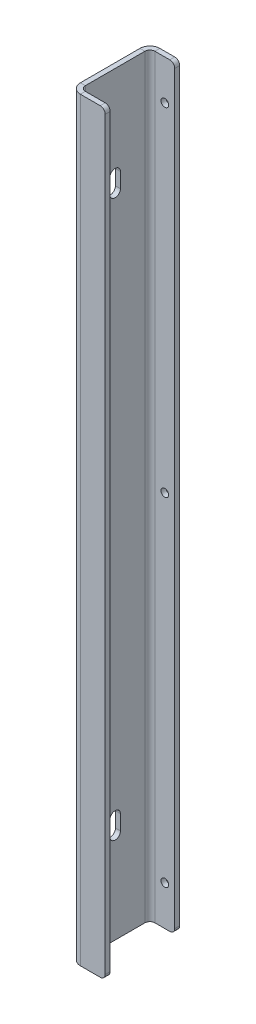
ISO-10303-21;
HEADER;
FILE_DESCRIPTION(('STEP AP214'),'2;1');
FILE_NAME('part.step','',(''),(''),'','','');
FILE_SCHEMA(('AUTOMOTIVE_DESIGN { 1 0 10303 214 1 1 1 1 }'));
ENDSEC;
DATA;
#1=APPLICATION_CONTEXT('core data for automotive mechanical design processes');
#2=APPLICATION_PROTOCOL_DEFINITION('international standard','automotive_design',2000,#1);
#3=PRODUCT_CONTEXT('',#1,'mechanical');
#4=PRODUCT('Part','Part','',(#3));
#5=PRODUCT_RELATED_PRODUCT_CATEGORY('part','',(#4));
#6=PRODUCT_DEFINITION_FORMATION('','',#4);
#7=PRODUCT_DEFINITION_CONTEXT('part definition',#1,'design');
#8=PRODUCT_DEFINITION('design','',#6,#7);
#9=PRODUCT_DEFINITION_SHAPE('','',#8);
#10=(LENGTH_UNIT() NAMED_UNIT(*) SI_UNIT(.MILLI.,.METRE.));
#11=(NAMED_UNIT(*) PLANE_ANGLE_UNIT() SI_UNIT($,.RADIAN.));
#12=(NAMED_UNIT(*) SI_UNIT($,.STERADIAN.) SOLID_ANGLE_UNIT());
#13=UNCERTAINTY_MEASURE_WITH_UNIT(LENGTH_MEASURE(1.E-05),#10,'distance_accuracy_value','');
#14=(GEOMETRIC_REPRESENTATION_CONTEXT(3) GLOBAL_UNCERTAINTY_ASSIGNED_CONTEXT((#13)) GLOBAL_UNIT_ASSIGNED_CONTEXT((#10,
#11,#12)) REPRESENTATION_CONTEXT('',''));
#15=CARTESIAN_POINT('',(0.,0.,0.));
#16=DIRECTION('',(0.,0.,1.));
#17=DIRECTION('',(1.,0.,0.));
#18=AXIS2_PLACEMENT_3D('',#15,#16,#17);
#19=CARTESIAN_POINT('',(-22.225,482.6,-6.35));
#20=DIRECTION('',(0.,1.,0.));
#21=DIRECTION('',(0.,0.,1.));
#22=AXIS2_PLACEMENT_3D('',#19,#20,#21);
#23=PLANE('',#22);
#24=DIRECTION('',(1.,0.,0.));
#25=VECTOR('',#24,1.);
#26=CARTESIAN_POINT('',(-22.225,482.6,-6.35));
#27=LINE('',#26,#25);
#28=CARTESIAN_POINT('',(-22.225,482.6,-6.35));
#29=VERTEX_POINT('',#28);
#30=CARTESIAN_POINT('',(-19.05,482.6,-6.35));
#31=VERTEX_POINT('',#30);
#32=EDGE_CURVE('E396',#29,#31,#27,.T.);
#33=ORIENTED_EDGE('',*,*,#32,.F.);
#34=CARTESIAN_POINT('',(-15.875,482.6,-6.35));
#35=DIRECTION('',(0.,1.,0.));
#36=DIRECTION('',(0.,0.,1.));
#37=AXIS2_PLACEMENT_3D('',#34,#35,#36);
#38=CIRCLE('',#37,6.35);
#39=CARTESIAN_POINT('',(-15.875,482.6,0.));
#40=VERTEX_POINT('',#39);
#41=EDGE_CURVE('E302',#40,#29,#38,.F.);
#42=ORIENTED_EDGE('',*,*,#41,.F.);
#43=DIRECTION('',(0.,0.,1.));
#44=VECTOR('',#43,1.);
#45=CARTESIAN_POINT('',(-15.875,482.6,-3.175));
#46=LINE('',#45,#44);
#47=CARTESIAN_POINT('',(-15.875,482.6,-3.175));
#48=VERTEX_POINT('',#47);
#49=EDGE_CURVE('E393',#48,#40,#46,.T.);
#50=ORIENTED_EDGE('',*,*,#49,.F.);
#51=CARTESIAN_POINT('',(-15.875,482.6,-6.35));
#52=DIRECTION('',(0.,1.,0.));
#53=DIRECTION('',(1.,0.,0.));
#54=AXIS2_PLACEMENT_3D('',#51,#52,#53);
#55=CIRCLE('',#54,3.175);
#56=EDGE_CURVE('E309',#48,#31,#55,.F.);
#57=ORIENTED_EDGE('',*,*,#56,.T.);
#58=EDGE_LOOP('',(#33,#42,#50,#57));
#59=FACE_BOUND('',#58,.T.);
#60=ADVANCED_FACE('F41',(#59),#23,.T.);
#61=CARTESIAN_POINT('',(-15.875,482.6,-3.175));
#62=DIRECTION('',(0.,1.,0.));
#63=DIRECTION('',(0.,0.,1.));
#64=AXIS2_PLACEMENT_3D('',#61,#62,#63);
#65=PLANE('',#64);
#66=DIRECTION('',(0.,0.,-1.));
#67=VECTOR('',#66,1.);
#68=CARTESIAN_POINT('',(-22.225,482.6,0.));
#69=LINE('',#68,#67);
#70=CARTESIAN_POINT('',(-22.225,482.6,-44.45));
#71=VERTEX_POINT('',#70);
#72=EDGE_CURVE('E299',#29,#71,#69,.T.);
#73=ORIENTED_EDGE('',*,*,#72,.F.);
#74=ORIENTED_EDGE('',*,*,#32,.T.);
#75=DIRECTION('',(0.,0.,-1.));
#76=VECTOR('',#75,1.);
#77=CARTESIAN_POINT('',(-19.05,482.6,0.));
#78=LINE('',#77,#76);
#79=CARTESIAN_POINT('',(-19.05,482.6,-44.45));
#80=VERTEX_POINT('',#79);
#81=EDGE_CURVE('E312',#31,#80,#78,.T.);
#82=ORIENTED_EDGE('',*,*,#81,.T.);
#83=DIRECTION('',(-1.,0.,0.));
#84=VECTOR('',#83,1.);
#85=CARTESIAN_POINT('',(-19.05,482.6,-44.45));
#86=LINE('',#85,#84);
#87=EDGE_CURVE('E384',#80,#71,#86,.T.);
#88=ORIENTED_EDGE('',*,*,#87,.T.);
#89=EDGE_LOOP('',(#73,#74,#82,#88));
#90=FACE_BOUND('',#89,.T.);
#91=ADVANCED_FACE('F487',(#90),#65,.T.);
#92=CARTESIAN_POINT('',(-15.875,0.,0.));
#93=DIRECTION('',(0.,-1.,0.));
#94=DIRECTION('',(0.,0.,-1.));
#95=AXIS2_PLACEMENT_3D('',#92,#93,#94);
#96=PLANE('',#95);
#97=DIRECTION('',(0.,0.,-1.));
#98=VECTOR('',#97,1.);
#99=CARTESIAN_POINT('',(-15.875,0.,0.));
#100=LINE('',#99,#98);
#101=CARTESIAN_POINT('',(-15.875,0.,0.));
#102=VERTEX_POINT('',#101);
#103=CARTESIAN_POINT('',(-15.875,0.,-3.175));
#104=VERTEX_POINT('',#103);
#105=EDGE_CURVE('E390',#102,#104,#100,.T.);
#106=ORIENTED_EDGE('',*,*,#105,.F.);
#107=CARTESIAN_POINT('',(-15.875,0.,-6.35));
#108=DIRECTION('',(0.,1.,0.));
#109=DIRECTION('',(0.,0.,1.));
#110=AXIS2_PLACEMENT_3D('',#107,#108,#109);
#111=CIRCLE('',#110,6.35);
#112=CARTESIAN_POINT('',(-22.225,0.,-6.35));
#113=VERTEX_POINT('',#112);
#114=EDGE_CURVE('E330',#102,#113,#111,.F.);
#115=ORIENTED_EDGE('',*,*,#114,.T.);
#116=DIRECTION('',(-1.,0.,0.));
#117=VECTOR('',#116,1.);
#118=CARTESIAN_POINT('',(-19.05,0.,-6.35));
#119=LINE('',#118,#117);
#120=CARTESIAN_POINT('',(-19.05,0.,-6.35));
#121=VERTEX_POINT('',#120);
#122=EDGE_CURVE('E388',#121,#113,#119,.T.);
#123=ORIENTED_EDGE('',*,*,#122,.F.);
#124=CARTESIAN_POINT('',(-15.875,0.,-6.35));
#125=DIRECTION('',(0.,1.,0.));
#126=DIRECTION('',(1.,0.,0.));
#127=AXIS2_PLACEMENT_3D('',#124,#125,#126);
#128=CIRCLE('',#127,3.175);
#129=EDGE_CURVE('E337',#104,#121,#128,.F.);
#130=ORIENTED_EDGE('',*,*,#129,.F.);
#131=EDGE_LOOP('',(#106,#115,#123,#130));
#132=FACE_BOUND('',#131,.T.);
#133=ADVANCED_FACE('F475',(#132),#96,.T.);
#134=CARTESIAN_POINT('',(-19.05,0.,-6.35));
#135=DIRECTION('',(0.,-1.,0.));
#136=DIRECTION('',(0.,0.,-1.));
#137=AXIS2_PLACEMENT_3D('',#134,#135,#136);
#138=PLANE('',#137);
#139=DIRECTION('',(-1.,0.,0.));
#140=VECTOR('',#139,1.);
#141=CARTESIAN_POINT('',(0.,0.,-3.175));
#142=LINE('',#141,#140);
#143=CARTESIAN_POINT('',(-3.175,0.,-3.175));
#144=VERTEX_POINT('',#143);
#145=EDGE_CURVE('E335',#144,#104,#142,.T.);
#146=ORIENTED_EDGE('',*,*,#145,.F.);
#147=DIRECTION('',(0.,0.,1.));
#148=VECTOR('',#147,1.);
#149=CARTESIAN_POINT('',(-3.175,0.,-6.35));
#150=LINE('',#149,#148);
#151=CARTESIAN_POINT('',(-3.175,0.,0.));
#152=VERTEX_POINT('',#151);
#153=EDGE_CURVE('E414',#144,#152,#150,.T.);
#154=ORIENTED_EDGE('',*,*,#153,.T.);
#155=DIRECTION('',(-1.,0.,0.));
#156=VECTOR('',#155,1.);
#157=CARTESIAN_POINT('',(0.,0.,0.));
#158=LINE('',#157,#156);
#159=EDGE_CURVE('E333',#152,#102,#158,.T.);
#160=ORIENTED_EDGE('',*,*,#159,.T.);
#161=ORIENTED_EDGE('',*,*,#105,.T.);
#162=EDGE_LOOP('',(#146,#154,#160,#161));
#163=FACE_BOUND('',#162,.T.);
#164=ADVANCED_FACE('F507',(#163),#138,.T.);
#165=CARTESIAN_POINT('',(-15.875,482.6,-50.8));
#166=DIRECTION('',(0.,1.,0.));
#167=DIRECTION('',(0.,0.,1.));
#168=AXIS2_PLACEMENT_3D('',#165,#166,#167);
#169=PLANE('',#168);
#170=DIRECTION('',(0.,0.,1.));
#171=VECTOR('',#170,1.);
#172=CARTESIAN_POINT('',(-15.875,482.6,-50.8));
#173=LINE('',#172,#171);
#174=CARTESIAN_POINT('',(-15.875,482.6,-50.8));
#175=VERTEX_POINT('',#174);
#176=CARTESIAN_POINT('',(-15.875,482.6,-47.625));
#177=VERTEX_POINT('',#176);
#178=EDGE_CURVE('E386',#175,#177,#173,.T.);
#179=ORIENTED_EDGE('',*,*,#178,.F.);
#180=CARTESIAN_POINT('',(-15.875,482.6,-44.45));
#181=DIRECTION('',(0.,1.,0.));
#182=DIRECTION('',(0.,0.,1.));
#183=AXIS2_PLACEMENT_3D('',#180,#181,#182);
#184=CIRCLE('',#183,6.35);
#185=EDGE_CURVE('E296',#71,#175,#184,.F.);
#186=ORIENTED_EDGE('',*,*,#185,.F.);
#187=ORIENTED_EDGE('',*,*,#87,.F.);
#188=CARTESIAN_POINT('',(-15.875,482.6,-44.45));
#189=DIRECTION('',(0.,1.,0.));
#190=DIRECTION('',(1.,0.,0.));
#191=AXIS2_PLACEMENT_3D('',#188,#189,#190);
#192=CIRCLE('',#191,3.175);
#193=EDGE_CURVE('E315',#80,#177,#192,.F.);
#194=ORIENTED_EDGE('',*,*,#193,.T.);
#195=EDGE_LOOP('',(#179,#186,#187,#194));
#196=FACE_BOUND('',#195,.T.);
#197=ADVANCED_FACE('F491',(#196),#169,.T.);
#198=CARTESIAN_POINT('',(-19.05,482.6,-44.45));
#199=DIRECTION('',(0.,1.,0.));
#200=DIRECTION('',(0.,0.,1.));
#201=AXIS2_PLACEMENT_3D('',#198,#199,#200);
#202=PLANE('',#201);
#203=DIRECTION('',(1.,0.,0.));
#204=VECTOR('',#203,1.);
#205=CARTESIAN_POINT('',(-22.225,482.6,-47.625));
#206=LINE('',#205,#204);
#207=CARTESIAN_POINT('',(-6.35,482.6,-47.625));
#208=VERTEX_POINT('',#207);
#209=EDGE_CURVE('E289',#177,#208,#206,.T.);
#210=ORIENTED_EDGE('',*,*,#209,.T.);
#211=DIRECTION('',(0.,0.,1.));
#212=VECTOR('',#211,1.);
#213=CARTESIAN_POINT('',(-6.35,482.6,-44.45));
#214=LINE('',#213,#212);
#215=CARTESIAN_POINT('',(-6.35,482.6,-50.8));
#216=VERTEX_POINT('',#215);
#217=EDGE_CURVE('E49',#208,#216,#214,.F.);
#218=ORIENTED_EDGE('',*,*,#217,.T.);
#219=DIRECTION('',(1.,0.,0.));
#220=VECTOR('',#219,1.);
#221=CARTESIAN_POINT('',(-22.225,482.6,-50.8));
#222=LINE('',#221,#220);
#223=EDGE_CURVE('E292',#175,#216,#222,.T.);
#224=ORIENTED_EDGE('',*,*,#223,.F.);
#225=ORIENTED_EDGE('',*,*,#178,.T.);
#226=EDGE_LOOP('',(#210,#218,#224,#225));
#227=FACE_BOUND('',#226,.T.);
#228=ADVANCED_FACE('F432',(#227),#202,.T.);
#229=CARTESIAN_POINT('',(-22.225,0.,-44.45));
#230=DIRECTION('',(0.,-1.,0.));
#231=DIRECTION('',(0.,0.,-1.));
#232=AXIS2_PLACEMENT_3D('',#229,#230,#231);
#233=PLANE('',#232);
#234=DIRECTION('',(1.,0.,0.));
#235=VECTOR('',#234,1.);
#236=CARTESIAN_POINT('',(-22.225,0.,-44.45));
#237=LINE('',#236,#235);
#238=CARTESIAN_POINT('',(-22.225,0.,-44.45));
#239=VERTEX_POINT('',#238);
#240=CARTESIAN_POINT('',(-19.05,0.,-44.45));
#241=VERTEX_POINT('',#240);
#242=EDGE_CURVE('E382',#239,#241,#237,.T.);
#243=ORIENTED_EDGE('',*,*,#242,.F.);
#244=CARTESIAN_POINT('',(-15.875,0.,-44.45));
#245=DIRECTION('',(0.,1.,0.));
#246=DIRECTION('',(0.,0.,1.));
#247=AXIS2_PLACEMENT_3D('',#244,#245,#246);
#248=CIRCLE('',#247,6.35);
#249=CARTESIAN_POINT('',(-15.875,0.,-50.8));
#250=VERTEX_POINT('',#249);
#251=EDGE_CURVE('E324',#239,#250,#248,.F.);
#252=ORIENTED_EDGE('',*,*,#251,.T.);
#253=DIRECTION('',(0.,0.,-1.));
#254=VECTOR('',#253,1.);
#255=CARTESIAN_POINT('',(-15.875,0.,-47.625));
#256=LINE('',#255,#254);
#257=CARTESIAN_POINT('',(-15.875,0.,-47.625));
#258=VERTEX_POINT('',#257);
#259=EDGE_CURVE('E380',#258,#250,#256,.T.);
#260=ORIENTED_EDGE('',*,*,#259,.F.);
#261=CARTESIAN_POINT('',(-15.875,0.,-44.45));
#262=DIRECTION('',(0.,1.,0.));
#263=DIRECTION('',(1.,0.,0.));
#264=AXIS2_PLACEMENT_3D('',#261,#262,#263);
#265=CIRCLE('',#264,3.175);
#266=EDGE_CURVE('E293',#241,#258,#265,.F.);
#267=ORIENTED_EDGE('',*,*,#266,.F.);
#268=EDGE_LOOP('',(#243,#252,#260,#267));
#269=FACE_BOUND('',#268,.T.);
#270=ADVANCED_FACE('F458',(#269),#233,.T.);
#271=CARTESIAN_POINT('',(-15.875,0.,-47.625));
#272=DIRECTION('',(0.,-1.,0.));
#273=DIRECTION('',(0.,0.,-1.));
#274=AXIS2_PLACEMENT_3D('',#271,#272,#273);
#275=PLANE('',#274);
#276=DIRECTION('',(0.,0.,-1.));
#277=VECTOR('',#276,1.);
#278=CARTESIAN_POINT('',(-22.225,0.,0.));
#279=LINE('',#278,#277);
#280=EDGE_CURVE('E327',#113,#239,#279,.T.);
#281=ORIENTED_EDGE('',*,*,#280,.T.);
#282=ORIENTED_EDGE('',*,*,#242,.T.);
#283=DIRECTION('',(0.,0.,-1.));
#284=VECTOR('',#283,1.);
#285=CARTESIAN_POINT('',(-19.05,0.,0.));
#286=LINE('',#285,#284);
#287=EDGE_CURVE('E340',#121,#241,#286,.T.);
#288=ORIENTED_EDGE('',*,*,#287,.F.);
#289=ORIENTED_EDGE('',*,*,#122,.T.);
#290=EDGE_LOOP('',(#281,#282,#288,#289));
#291=FACE_BOUND('',#290,.T.);
#292=ADVANCED_FACE('F466',(#291),#275,.T.);
#293=CARTESIAN_POINT('',(-22.225,482.6,-47.625));
#294=DIRECTION('',(0.,0.,-1.));
#295=DIRECTION('',(-1.,0.,0.));
#296=AXIS2_PLACEMENT_3D('',#293,#294,#295);
#297=PLANE('',#296);
#298=CARTESIAN_POINT('',(-9.525,457.2,-47.625));
#299=DIRECTION('',(0.,0.,-1.));
#300=DIRECTION('',(-1.,0.,0.));
#301=AXIS2_PLACEMENT_3D('',#298,#299,#300);
#302=CIRCLE('',#301,2.45745000000004);
#303=CARTESIAN_POINT('',(-11.98245,457.2,-47.625));
#304=VERTEX_POINT('',#303);
#305=EDGE_CURVE('E271',#304,#304,#302,.T.);
#306=ORIENTED_EDGE('',*,*,#305,.T.);
#307=EDGE_LOOP('',(#306));
#308=FACE_BOUND('',#307,.T.);
#309=CARTESIAN_POINT('',(-9.525,25.4,-47.625));
#310=DIRECTION('',(0.,0.,-1.));
#311=DIRECTION('',(-1.,0.,0.));
#312=AXIS2_PLACEMENT_3D('',#309,#310,#311);
#313=CIRCLE('',#312,2.45745);
#314=CARTESIAN_POINT('',(-11.98245,25.4,-47.625));
#315=VERTEX_POINT('',#314);
#316=EDGE_CURVE('E278',#315,#315,#313,.T.);
#317=ORIENTED_EDGE('',*,*,#316,.T.);
#318=EDGE_LOOP('',(#317));
#319=FACE_BOUND('',#318,.T.);
#320=CARTESIAN_POINT('',(-9.525,241.3,-47.625));
#321=DIRECTION('',(0.,0.,-1.));
#322=DIRECTION('',(-1.,0.,0.));
#323=AXIS2_PLACEMENT_3D('',#320,#321,#322);
#324=CIRCLE('',#323,2.45745);
#325=CARTESIAN_POINT('',(-11.98245,241.3,-47.625));
#326=VERTEX_POINT('',#325);
#327=EDGE_CURVE('E284',#326,#326,#324,.T.);
#328=ORIENTED_EDGE('',*,*,#327,.T.);
#329=EDGE_LOOP('',(#328));
#330=FACE_BOUND('',#329,.T.);
#331=DIRECTION('',(1.,0.,0.));
#332=VECTOR('',#331,1.);
#333=CARTESIAN_POINT('',(-22.225,0.,-47.625));
#334=LINE('',#333,#332);
#335=CARTESIAN_POINT('',(-6.35,0.,-47.625));
#336=VERTEX_POINT('',#335);
#337=EDGE_CURVE('E274',#258,#336,#334,.T.);
#338=ORIENTED_EDGE('',*,*,#337,.T.);
#339=CARTESIAN_POINT('',(-6.35,3.175,-47.625));
#340=DIRECTION('',(0.,0.,-1.));
#341=DIRECTION('',(-1.,0.,0.));
#342=AXIS2_PLACEMENT_3D('',#339,#340,#341);
#343=CIRCLE('',#342,3.175);
#344=CARTESIAN_POINT('',(-3.175,3.17500000000009,-47.625));
#345=VERTEX_POINT('',#344);
#346=EDGE_CURVE('E403',#336,#345,#343,.F.);
#347=ORIENTED_EDGE('',*,*,#346,.T.);
#348=DIRECTION('',(0.,-1.,0.));
#349=VECTOR('',#348,1.);
#350=CARTESIAN_POINT('',(-3.175,482.6,-47.625));
#351=LINE('',#350,#349);
#352=CARTESIAN_POINT('',(-3.175,479.425,-47.625));
#353=VERTEX_POINT('',#352);
#354=EDGE_CURVE('E377',#353,#345,#351,.T.);
#355=ORIENTED_EDGE('',*,*,#354,.F.);
#356=CARTESIAN_POINT('',(-6.35,479.425,-47.625));
#357=DIRECTION('',(0.,0.,-1.));
#358=DIRECTION('',(-1.,0.,0.));
#359=AXIS2_PLACEMENT_3D('',#356,#357,#358);
#360=CIRCLE('',#359,3.175);
#361=EDGE_CURVE('E401',#353,#208,#360,.F.);
#362=ORIENTED_EDGE('',*,*,#361,.T.);
#363=ORIENTED_EDGE('',*,*,#209,.F.);
#364=DIRECTION('',(0.,-1.,0.));
#365=VECTOR('',#364,1.);
#366=CARTESIAN_POINT('',(-15.875,482.6,-47.625));
#367=LINE('',#366,#365);
#368=EDGE_CURVE('E318',#177,#258,#367,.T.);
#369=ORIENTED_EDGE('',*,*,#368,.T.);
#370=EDGE_LOOP('',(#338,#347,#355,#362,#363,#369));
#371=FACE_BOUND('',#370,.T.);
#372=ADVANCED_FACE('F448',(#308,#319,#330,#371),#297,.F.);
#373=CARTESIAN_POINT('',(-3.175,482.6,-50.8));
#374=DIRECTION('',(1.,0.,0.));
#375=DIRECTION('',(0.,0.,-1.));
#376=AXIS2_PLACEMENT_3D('',#373,#374,#375);
#377=PLANE('',#376);
#378=ORIENTED_EDGE('',*,*,#354,.T.);
#379=DIRECTION('',(0.,0.,1.));
#380=VECTOR('',#379,1.);
#381=CARTESIAN_POINT('',(-3.175,3.175,-50.8));
#382=LINE('',#381,#380);
#383=CARTESIAN_POINT('',(-3.175,3.17500000000009,-50.8));
#384=VERTEX_POINT('',#383);
#385=EDGE_CURVE('E408',#345,#384,#382,.F.);
#386=ORIENTED_EDGE('',*,*,#385,.T.);
#387=DIRECTION('',(0.,-1.,0.));
#388=VECTOR('',#387,1.);
#389=CARTESIAN_POINT('',(-3.175,482.6,-50.8));
#390=LINE('',#389,#388);
#391=CARTESIAN_POINT('',(-3.175,479.425,-50.8));
#392=VERTEX_POINT('',#391);
#393=EDGE_CURVE('E374',#392,#384,#390,.T.);
#394=ORIENTED_EDGE('',*,*,#393,.F.);
#395=DIRECTION('',(0.,0.,1.));
#396=VECTOR('',#395,1.);
#397=CARTESIAN_POINT('',(-3.175,479.425,-50.8));
#398=LINE('',#397,#396);
#399=EDGE_CURVE('E405',#392,#353,#398,.T.);
#400=ORIENTED_EDGE('',*,*,#399,.T.);
#401=EDGE_LOOP('',(#378,#386,#394,#400));
#402=FACE_BOUND('',#401,.T.);
#403=ADVANCED_FACE('F445',(#402),#377,.T.);
#404=CARTESIAN_POINT('',(-22.225,482.6,-50.8));
#405=DIRECTION('',(0.,0.,-1.));
#406=DIRECTION('',(-1.,0.,0.));
#407=AXIS2_PLACEMENT_3D('',#404,#405,#406);
#408=PLANE('',#407);
#409=CARTESIAN_POINT('',(-9.525,457.2,-50.8));
#410=DIRECTION('',(0.,0.,-1.));
#411=DIRECTION('',(-1.,0.,0.));
#412=AXIS2_PLACEMENT_3D('',#409,#410,#411);
#413=CIRCLE('',#412,2.45745000000004);
#414=CARTESIAN_POINT('',(-11.98245,457.2,-50.8));
#415=VERTEX_POINT('',#414);
#416=EDGE_CURVE('E275',#415,#415,#413,.T.);
#417=ORIENTED_EDGE('',*,*,#416,.F.);
#418=EDGE_LOOP('',(#417));
#419=FACE_BOUND('',#418,.T.);
#420=CARTESIAN_POINT('',(-9.525,25.4,-50.8));
#421=DIRECTION('',(0.,0.,-1.));
#422=DIRECTION('',(-1.,0.,0.));
#423=AXIS2_PLACEMENT_3D('',#420,#421,#422);
#424=CIRCLE('',#423,2.45745);
#425=CARTESIAN_POINT('',(-11.98245,25.4,-50.8));
#426=VERTEX_POINT('',#425);
#427=EDGE_CURVE('E281',#426,#426,#424,.T.);
#428=ORIENTED_EDGE('',*,*,#427,.F.);
#429=EDGE_LOOP('',(#428));
#430=FACE_BOUND('',#429,.T.);
#431=CARTESIAN_POINT('',(-9.525,241.3,-50.8));
#432=DIRECTION('',(0.,0.,-1.));
#433=DIRECTION('',(-1.,0.,0.));
#434=AXIS2_PLACEMENT_3D('',#431,#432,#433);
#435=CIRCLE('',#434,2.45745);
#436=CARTESIAN_POINT('',(-11.98245,241.3,-50.8));
#437=VERTEX_POINT('',#436);
#438=EDGE_CURVE('E238',#437,#437,#435,.T.);
#439=ORIENTED_EDGE('',*,*,#438,.F.);
#440=EDGE_LOOP('',(#439));
#441=FACE_BOUND('',#440,.T.);
#442=ORIENTED_EDGE('',*,*,#393,.T.);
#443=CARTESIAN_POINT('',(-6.35,3.175,-50.8));
#444=DIRECTION('',(0.,0.,-1.));
#445=DIRECTION('',(-1.,0.,0.));
#446=AXIS2_PLACEMENT_3D('',#443,#444,#445);
#447=CIRCLE('',#446,3.175);
#448=CARTESIAN_POINT('',(-6.35,0.,-50.8));
#449=VERTEX_POINT('',#448);
#450=EDGE_CURVE('E412',#384,#449,#447,.T.);
#451=ORIENTED_EDGE('',*,*,#450,.T.);
#452=DIRECTION('',(1.,0.,0.));
#453=VECTOR('',#452,1.);
#454=CARTESIAN_POINT('',(-22.225,0.,-50.8));
#455=LINE('',#454,#453);
#456=EDGE_CURVE('E321',#250,#449,#455,.T.);
#457=ORIENTED_EDGE('',*,*,#456,.F.);
#458=DIRECTION('',(0.,-1.,0.));
#459=VECTOR('',#458,1.);
#460=CARTESIAN_POINT('',(-15.875,482.6,-50.8));
#461=LINE('',#460,#459);
#462=EDGE_CURVE('E371',#175,#250,#461,.T.);
#463=ORIENTED_EDGE('',*,*,#462,.F.);
#464=ORIENTED_EDGE('',*,*,#223,.T.);
#465=CARTESIAN_POINT('',(-6.35,479.425,-50.8));
#466=DIRECTION('',(0.,0.,-1.));
#467=DIRECTION('',(-1.,0.,0.));
#468=AXIS2_PLACEMENT_3D('',#465,#466,#467);
#469=CIRCLE('',#468,3.175);
#470=EDGE_CURVE('E410',#216,#392,#469,.T.);
#471=ORIENTED_EDGE('',*,*,#470,.T.);
#472=EDGE_LOOP('',(#442,#451,#457,#463,#464,#471));
#473=FACE_BOUND('',#472,.T.);
#474=ADVANCED_FACE('F438',(#419,#430,#441,#473),#408,.T.);
#475=CARTESIAN_POINT('',(-15.875,482.6,-44.45));
#476=DIRECTION('',(0.,-1.,0.));
#477=DIRECTION('',(0.,0.,-1.));
#478=AXIS2_PLACEMENT_3D('',#475,#476,#477);
#479=CYLINDRICAL_SURFACE('',#478,6.35);
#480=ORIENTED_EDGE('',*,*,#251,.F.);
#481=DIRECTION('',(0.,-1.,0.));
#482=VECTOR('',#481,1.);
#483=CARTESIAN_POINT('',(-22.225,482.6,-44.45));
#484=LINE('',#483,#482);
#485=EDGE_CURVE('E368',#71,#239,#484,.T.);
#486=ORIENTED_EDGE('',*,*,#485,.F.);
#487=ORIENTED_EDGE('',*,*,#185,.T.);
#488=ORIENTED_EDGE('',*,*,#462,.T.);
#489=EDGE_LOOP('',(#480,#486,#487,#488));
#490=FACE_BOUND('',#489,.T.);
#491=ADVANCED_FACE('F462',(#490),#479,.T.);
#492=CARTESIAN_POINT('',(-22.225,482.6,0.));
#493=DIRECTION('',(-1.,0.,0.));
#494=DIRECTION('',(0.,0.,1.));
#495=AXIS2_PLACEMENT_3D('',#492,#493,#494);
#496=PLANE('',#495);
#497=CARTESIAN_POINT('',(-22.225,423.8625,-25.4));
#498=DIRECTION('',(-1.,0.,0.));
#499=DIRECTION('',(0.,0.,1.));
#500=AXIS2_PLACEMENT_3D('',#497,#498,#499);
#501=CIRCLE('',#500,3.37343749999999);
#502=CARTESIAN_POINT('',(-22.225,423.8625,-22.0265625));
#503=VERTEX_POINT('',#502);
#504=CARTESIAN_POINT('',(-22.225,423.8625,-28.7734375));
#505=VERTEX_POINT('',#504);
#506=EDGE_CURVE('E56',#503,#505,#501,.T.);
#507=ORIENTED_EDGE('',*,*,#506,.F.);
#508=DIRECTION('',(0.,1.,0.));
#509=VECTOR('',#508,1.);
#510=CARTESIAN_POINT('',(-22.225,423.8625,-22.0265625));
#511=LINE('',#510,#509);
#512=CARTESIAN_POINT('',(-22.225,414.3375,-22.0265625));
#513=VERTEX_POINT('',#512);
#514=EDGE_CURVE('E222',#513,#503,#511,.T.);
#515=ORIENTED_EDGE('',*,*,#514,.F.);
#516=CARTESIAN_POINT('',(-22.225,414.3375,-25.4));
#517=DIRECTION('',(-1.,0.,0.));
#518=DIRECTION('',(0.,0.,1.));
#519=AXIS2_PLACEMENT_3D('',#516,#517,#518);
#520=CIRCLE('',#519,3.37343749999999);
#521=CARTESIAN_POINT('',(-22.225,414.3375,-28.7734375));
#522=VERTEX_POINT('',#521);
#523=EDGE_CURVE('E225',#522,#513,#520,.T.);
#524=ORIENTED_EDGE('',*,*,#523,.F.);
#525=DIRECTION('',(0.,-1.,0.));
#526=VECTOR('',#525,1.);
#527=CARTESIAN_POINT('',(-22.225,423.8625,-28.7734375));
#528=LINE('',#527,#526);
#529=EDGE_CURVE('E231',#505,#522,#528,.T.);
#530=ORIENTED_EDGE('',*,*,#529,.F.);
#531=EDGE_LOOP('',(#507,#515,#524,#530));
#532=FACE_BOUND('',#531,.T.);
#533=CARTESIAN_POINT('',(-22.225,58.7375,-25.4));
#534=DIRECTION('',(-1.,0.,0.));
#535=DIRECTION('',(0.,0.,1.));
#536=AXIS2_PLACEMENT_3D('',#533,#534,#535);
#537=CIRCLE('',#536,3.3734375);
#538=CARTESIAN_POINT('',(-22.225,58.7375,-28.7734375));
#539=VERTEX_POINT('',#538);
#540=CARTESIAN_POINT('',(-22.225,58.7375,-22.0265625));
#541=VERTEX_POINT('',#540);
#542=EDGE_CURVE('E64',#539,#541,#537,.T.);
#543=ORIENTED_EDGE('',*,*,#542,.F.);
#544=DIRECTION('',(0.,-1.,0.));
#545=VECTOR('',#544,1.);
#546=CARTESIAN_POINT('',(-22.225,58.7375,-28.7734375));
#547=LINE('',#546,#545);
#548=CARTESIAN_POINT('',(-22.225,68.2625,-28.7734375));
#549=VERTEX_POINT('',#548);
#550=EDGE_CURVE('E246',#549,#539,#547,.T.);
#551=ORIENTED_EDGE('',*,*,#550,.F.);
#552=CARTESIAN_POINT('',(-22.225,68.2625,-25.4));
#553=DIRECTION('',(-1.,0.,0.));
#554=DIRECTION('',(0.,0.,1.));
#555=AXIS2_PLACEMENT_3D('',#552,#553,#554);
#556=CIRCLE('',#555,3.3734375);
#557=CARTESIAN_POINT('',(-22.225,68.2625,-22.0265625));
#558=VERTEX_POINT('',#557);
#559=EDGE_CURVE('E260',#558,#549,#556,.T.);
#560=ORIENTED_EDGE('',*,*,#559,.F.);
#561=DIRECTION('',(0.,1.,0.));
#562=VECTOR('',#561,1.);
#563=CARTESIAN_POINT('',(-22.225,58.7375,-22.0265625));
#564=LINE('',#563,#562);
#565=EDGE_CURVE('E257',#541,#558,#564,.T.);
#566=ORIENTED_EDGE('',*,*,#565,.F.);
#567=EDGE_LOOP('',(#543,#551,#560,#566));
#568=FACE_BOUND('',#567,.T.);
#569=ORIENTED_EDGE('',*,*,#280,.F.);
#570=DIRECTION('',(0.,-1.,0.));
#571=VECTOR('',#570,1.);
#572=CARTESIAN_POINT('',(-22.225,482.6,-6.35));
#573=LINE('',#572,#571);
#574=EDGE_CURVE('E365',#29,#113,#573,.T.);
#575=ORIENTED_EDGE('',*,*,#574,.F.);
#576=ORIENTED_EDGE('',*,*,#72,.T.);
#577=ORIENTED_EDGE('',*,*,#485,.T.);
#578=EDGE_LOOP('',(#569,#575,#576,#577));
#579=FACE_BOUND('',#578,.T.);
#580=ADVANCED_FACE('F470',(#532,#568,#579),#496,.T.);
#581=CARTESIAN_POINT('',(-15.875,482.6,-6.35));
#582=DIRECTION('',(0.,-1.,0.));
#583=DIRECTION('',(0.,0.,-1.));
#584=AXIS2_PLACEMENT_3D('',#581,#582,#583);
#585=CYLINDRICAL_SURFACE('',#584,6.35);
#586=ORIENTED_EDGE('',*,*,#114,.F.);
#587=DIRECTION('',(0.,-1.,0.));
#588=VECTOR('',#587,1.);
#589=CARTESIAN_POINT('',(-15.875,482.6,0.));
#590=LINE('',#589,#588);
#591=EDGE_CURVE('E362',#40,#102,#590,.T.);
#592=ORIENTED_EDGE('',*,*,#591,.F.);
#593=ORIENTED_EDGE('',*,*,#41,.T.);
#594=ORIENTED_EDGE('',*,*,#574,.T.);
#595=EDGE_LOOP('',(#586,#592,#593,#594));
#596=FACE_BOUND('',#595,.T.);
#597=ADVANCED_FACE('F479',(#596),#585,.T.);
#598=CARTESIAN_POINT('',(0.,482.6,0.));
#599=DIRECTION('',(0.,0.,1.));
#600=DIRECTION('',(1.,0.,0.));
#601=AXIS2_PLACEMENT_3D('',#598,#599,#600);
#602=PLANE('',#601);
#603=ORIENTED_EDGE('',*,*,#159,.F.);
#604=CARTESIAN_POINT('',(-3.175,3.175,0.));
#605=DIRECTION('',(0.,0.,1.));
#606=DIRECTION('',(1.,0.,0.));
#607=AXIS2_PLACEMENT_3D('',#604,#605,#606);
#608=CIRCLE('',#607,3.175);
#609=CARTESIAN_POINT('',(0.,3.17500000000009,0.));
#610=VERTEX_POINT('',#609);
#611=EDGE_CURVE('E419',#152,#610,#608,.T.);
#612=ORIENTED_EDGE('',*,*,#611,.T.);
#613=DIRECTION('',(0.,-1.,0.));
#614=VECTOR('',#613,1.);
#615=CARTESIAN_POINT('',(0.,482.6,0.));
#616=LINE('',#615,#614);
#617=CARTESIAN_POINT('',(0.,479.425,0.));
#618=VERTEX_POINT('',#617);
#619=EDGE_CURVE('E359',#618,#610,#616,.T.);
#620=ORIENTED_EDGE('',*,*,#619,.F.);
#621=CARTESIAN_POINT('',(-3.175,479.425,0.));
#622=DIRECTION('',(0.,0.,1.));
#623=DIRECTION('',(1.,0.,0.));
#624=AXIS2_PLACEMENT_3D('',#621,#622,#623);
#625=CIRCLE('',#624,3.175);
#626=CARTESIAN_POINT('',(-3.175,482.6,0.));
#627=VERTEX_POINT('',#626);
#628=EDGE_CURVE('E417',#618,#627,#625,.T.);
#629=ORIENTED_EDGE('',*,*,#628,.T.);
#630=DIRECTION('',(-1.,0.,0.));
#631=VECTOR('',#630,1.);
#632=CARTESIAN_POINT('',(0.,482.6,0.));
#633=LINE('',#632,#631);
#634=EDGE_CURVE('E305',#627,#40,#633,.T.);
#635=ORIENTED_EDGE('',*,*,#634,.T.);
#636=ORIENTED_EDGE('',*,*,#591,.T.);
#637=EDGE_LOOP('',(#603,#612,#620,#629,#635,#636));
#638=FACE_BOUND('',#637,.T.);
#639=ADVANCED_FACE('F510',(#638),#602,.T.);
#640=CARTESIAN_POINT('',(0.,482.6,-3.175));
#641=DIRECTION('',(1.,0.,0.));
#642=DIRECTION('',(0.,0.,-1.));
#643=AXIS2_PLACEMENT_3D('',#640,#641,#642);
#644=PLANE('',#643);
#645=ORIENTED_EDGE('',*,*,#619,.T.);
#646=DIRECTION('',(0.,0.,1.));
#647=VECTOR('',#646,1.);
#648=CARTESIAN_POINT('',(0.,3.17499999999998,-3.175));
#649=LINE('',#648,#647);
#650=CARTESIAN_POINT('',(0.,3.17500000000009,-3.175));
#651=VERTEX_POINT('',#650);
#652=EDGE_CURVE('E424',#610,#651,#649,.F.);
#653=ORIENTED_EDGE('',*,*,#652,.T.);
#654=DIRECTION('',(0.,-1.,0.));
#655=VECTOR('',#654,1.);
#656=CARTESIAN_POINT('',(0.,482.6,-3.175));
#657=LINE('',#656,#655);
#658=CARTESIAN_POINT('',(0.,479.425,-3.175));
#659=VERTEX_POINT('',#658);
#660=EDGE_CURVE('E356',#659,#651,#657,.T.);
#661=ORIENTED_EDGE('',*,*,#660,.F.);
#662=DIRECTION('',(0.,0.,1.));
#663=VECTOR('',#662,1.);
#664=CARTESIAN_POINT('',(0.,479.425,-3.175));
#665=LINE('',#664,#663);
#666=EDGE_CURVE('E421',#659,#618,#665,.T.);
#667=ORIENTED_EDGE('',*,*,#666,.T.);
#668=EDGE_LOOP('',(#645,#653,#661,#667));
#669=FACE_BOUND('',#668,.T.);
#670=ADVANCED_FACE('F520',(#669),#644,.T.);
#671=CARTESIAN_POINT('',(0.,482.6,-3.175));
#672=DIRECTION('',(0.,0.,1.));
#673=DIRECTION('',(1.,0.,0.));
#674=AXIS2_PLACEMENT_3D('',#671,#672,#673);
#675=PLANE('',#674);
#676=ORIENTED_EDGE('',*,*,#660,.T.);
#677=CARTESIAN_POINT('',(-3.175,3.175,-3.175));
#678=DIRECTION('',(0.,0.,1.));
#679=DIRECTION('',(1.,0.,0.));
#680=AXIS2_PLACEMENT_3D('',#677,#678,#679);
#681=CIRCLE('',#680,3.175);
#682=EDGE_CURVE('E428',#651,#144,#681,.F.);
#683=ORIENTED_EDGE('',*,*,#682,.T.);
#684=ORIENTED_EDGE('',*,*,#145,.T.);
#685=DIRECTION('',(0.,-1.,0.));
#686=VECTOR('',#685,1.);
#687=CARTESIAN_POINT('',(-15.875,482.6,-3.175));
#688=LINE('',#687,#686);
#689=EDGE_CURVE('E353',#48,#104,#688,.T.);
#690=ORIENTED_EDGE('',*,*,#689,.F.);
#691=DIRECTION('',(-1.,0.,0.));
#692=VECTOR('',#691,1.);
#693=CARTESIAN_POINT('',(0.,482.6,-3.175));
#694=LINE('',#693,#692);
#695=CARTESIAN_POINT('',(-3.175,482.6,-3.175));
#696=VERTEX_POINT('',#695);
#697=EDGE_CURVE('E307',#696,#48,#694,.T.);
#698=ORIENTED_EDGE('',*,*,#697,.F.);
#699=CARTESIAN_POINT('',(-3.175,479.425,-3.175));
#700=DIRECTION('',(0.,0.,1.));
#701=DIRECTION('',(1.,0.,0.));
#702=AXIS2_PLACEMENT_3D('',#699,#700,#701);
#703=CIRCLE('',#702,3.175);
#704=EDGE_CURVE('E426',#696,#659,#703,.F.);
#705=ORIENTED_EDGE('',*,*,#704,.T.);
#706=EDGE_LOOP('',(#676,#683,#684,#690,#698,#705));
#707=FACE_BOUND('',#706,.T.);
#708=ADVANCED_FACE('F501',(#707),#675,.F.);
#709=CARTESIAN_POINT('',(-15.875,482.6,-6.35));
#710=DIRECTION('',(0.,-1.,0.));
#711=DIRECTION('',(0.,0.,-1.));
#712=AXIS2_PLACEMENT_3D('',#709,#710,#711);
#713=CYLINDRICAL_SURFACE('',#712,3.175);
#714=ORIENTED_EDGE('',*,*,#129,.T.);
#715=DIRECTION('',(0.,-1.,0.));
#716=VECTOR('',#715,1.);
#717=CARTESIAN_POINT('',(-19.05,482.6,-6.35));
#718=LINE('',#717,#716);
#719=EDGE_CURVE('E350',#31,#121,#718,.T.);
#720=ORIENTED_EDGE('',*,*,#719,.F.);
#721=ORIENTED_EDGE('',*,*,#56,.F.);
#722=ORIENTED_EDGE('',*,*,#689,.T.);
#723=EDGE_LOOP('',(#714,#720,#721,#722));
#724=FACE_BOUND('',#723,.T.);
#725=ADVANCED_FACE('F498',(#724),#713,.F.);
#726=CARTESIAN_POINT('',(-19.05,482.6,0.));
#727=DIRECTION('',(-1.,0.,0.));
#728=DIRECTION('',(0.,0.,1.));
#729=AXIS2_PLACEMENT_3D('',#726,#727,#728);
#730=PLANE('',#729);
#731=DIRECTION('',(0.,1.,0.));
#732=VECTOR('',#731,1.);
#733=CARTESIAN_POINT('',(-19.05,423.8625,-22.0265625));
#734=LINE('',#733,#732);
#735=CARTESIAN_POINT('',(-19.05,414.3375,-22.0265625));
#736=VERTEX_POINT('',#735);
#737=CARTESIAN_POINT('',(-19.05,423.8625,-22.0265625));
#738=VERTEX_POINT('',#737);
#739=EDGE_CURVE('E209',#736,#738,#734,.T.);
#740=ORIENTED_EDGE('',*,*,#739,.T.);
#741=CARTESIAN_POINT('',(-19.05,423.8625,-25.4));
#742=DIRECTION('',(-1.,0.,0.));
#743=DIRECTION('',(0.,0.,1.));
#744=AXIS2_PLACEMENT_3D('',#741,#742,#743);
#745=CIRCLE('',#744,3.37343749999999);
#746=CARTESIAN_POINT('',(-19.05,423.8625,-28.7734375));
#747=VERTEX_POINT('',#746);
#748=EDGE_CURVE('E203',#738,#747,#745,.T.);
#749=ORIENTED_EDGE('',*,*,#748,.T.);
#750=DIRECTION('',(0.,-1.,0.));
#751=VECTOR('',#750,1.);
#752=CARTESIAN_POINT('',(-19.05,423.8625,-28.7734375));
#753=LINE('',#752,#751);
#754=CARTESIAN_POINT('',(-19.05,414.3375,-28.7734375));
#755=VERTEX_POINT('',#754);
#756=EDGE_CURVE('E213',#747,#755,#753,.T.);
#757=ORIENTED_EDGE('',*,*,#756,.T.);
#758=CARTESIAN_POINT('',(-19.05,414.3375,-25.4));
#759=DIRECTION('',(-1.,0.,0.));
#760=DIRECTION('',(0.,0.,1.));
#761=AXIS2_PLACEMENT_3D('',#758,#759,#760);
#762=CIRCLE('',#761,3.37343749999999);
#763=EDGE_CURVE('E217',#755,#736,#762,.T.);
#764=ORIENTED_EDGE('',*,*,#763,.T.);
#765=EDGE_LOOP('',(#740,#749,#757,#764));
#766=FACE_BOUND('',#765,.T.);
#767=DIRECTION('',(0.,-1.,0.));
#768=VECTOR('',#767,1.);
#769=CARTESIAN_POINT('',(-19.05,58.7375,-28.7734375));
#770=LINE('',#769,#768);
#771=CARTESIAN_POINT('',(-19.05,68.2625,-28.7734375));
#772=VERTEX_POINT('',#771);
#773=CARTESIAN_POINT('',(-19.05,58.7375,-28.7734375));
#774=VERTEX_POINT('',#773);
#775=EDGE_CURVE('E252',#772,#774,#770,.T.);
#776=ORIENTED_EDGE('',*,*,#775,.T.);
#777=CARTESIAN_POINT('',(-19.05,58.7375,-25.4));
#778=DIRECTION('',(-1.,0.,0.));
#779=DIRECTION('',(0.,0.,1.));
#780=AXIS2_PLACEMENT_3D('',#777,#778,#779);
#781=CIRCLE('',#780,3.3734375);
#782=CARTESIAN_POINT('',(-19.05,58.7375,-22.0265625));
#783=VERTEX_POINT('',#782);
#784=EDGE_CURVE('E242',#774,#783,#781,.T.);
#785=ORIENTED_EDGE('',*,*,#784,.T.);
#786=DIRECTION('',(0.,1.,0.));
#787=VECTOR('',#786,1.);
#788=CARTESIAN_POINT('',(-19.05,58.7375,-22.0265625));
#789=LINE('',#788,#787);
#790=CARTESIAN_POINT('',(-19.05,68.2625,-22.0265625));
#791=VERTEX_POINT('',#790);
#792=EDGE_CURVE('E245',#783,#791,#789,.T.);
#793=ORIENTED_EDGE('',*,*,#792,.T.);
#794=CARTESIAN_POINT('',(-19.05,68.2625,-25.4));
#795=DIRECTION('',(-1.,0.,0.));
#796=DIRECTION('',(0.,0.,1.));
#797=AXIS2_PLACEMENT_3D('',#794,#795,#796);
#798=CIRCLE('',#797,3.3734375);
#799=EDGE_CURVE('E249',#791,#772,#798,.T.);
#800=ORIENTED_EDGE('',*,*,#799,.T.);
#801=EDGE_LOOP('',(#776,#785,#793,#800));
#802=FACE_BOUND('',#801,.T.);
#803=ORIENTED_EDGE('',*,*,#287,.T.);
#804=DIRECTION('',(0.,-1.,0.));
#805=VECTOR('',#804,1.);
#806=CARTESIAN_POINT('',(-19.05,482.6,-44.45));
#807=LINE('',#806,#805);
#808=EDGE_CURVE('E347',#80,#241,#807,.T.);
#809=ORIENTED_EDGE('',*,*,#808,.F.);
#810=ORIENTED_EDGE('',*,*,#81,.F.);
#811=ORIENTED_EDGE('',*,*,#719,.T.);
#812=EDGE_LOOP('',(#803,#809,#810,#811));
#813=FACE_BOUND('',#812,.T.);
#814=ADVANCED_FACE('F219',(#766,#802,#813),#730,.F.);
#815=CARTESIAN_POINT('',(-15.875,482.6,-44.45));
#816=DIRECTION('',(0.,-1.,0.));
#817=DIRECTION('',(0.,0.,-1.));
#818=AXIS2_PLACEMENT_3D('',#815,#816,#817);
#819=CYLINDRICAL_SURFACE('',#818,3.175);
#820=ORIENTED_EDGE('',*,*,#266,.T.);
#821=ORIENTED_EDGE('',*,*,#368,.F.);
#822=ORIENTED_EDGE('',*,*,#193,.F.);
#823=ORIENTED_EDGE('',*,*,#808,.T.);
#824=EDGE_LOOP('',(#820,#821,#822,#823));
#825=FACE_BOUND('',#824,.T.);
#826=ADVANCED_FACE('F495',(#825),#819,.F.);
#827=CARTESIAN_POINT('',(-15.875,482.6,-44.45));
#828=DIRECTION('',(0.,1.,0.));
#829=DIRECTION('',(1.,0.,0.));
#830=AXIS2_PLACEMENT_3D('',#827,#828,#829);
#831=PLANE('',#830);
#832=ORIENTED_EDGE('',*,*,#634,.F.);
#833=DIRECTION('',(0.,0.,1.));
#834=VECTOR('',#833,1.);
#835=CARTESIAN_POINT('',(-3.17500000000001,482.6,-44.45));
#836=LINE('',#835,#834);
#837=EDGE_CURVE('E11',#627,#696,#836,.F.);
#838=ORIENTED_EDGE('',*,*,#837,.T.);
#839=ORIENTED_EDGE('',*,*,#697,.T.);
#840=ORIENTED_EDGE('',*,*,#49,.T.);
#841=EDGE_LOOP('',(#832,#838,#839,#840));
#842=FACE_BOUND('',#841,.T.);
#843=ADVANCED_FACE('F515',(#842),#831,.T.);
#844=CARTESIAN_POINT('',(-15.875,0.,-44.45));
#845=DIRECTION('',(0.,1.,0.));
#846=DIRECTION('',(1.,0.,0.));
#847=AXIS2_PLACEMENT_3D('',#844,#845,#846);
#848=PLANE('',#847);
#849=ORIENTED_EDGE('',*,*,#456,.T.);
#850=DIRECTION('',(0.,0.,1.));
#851=VECTOR('',#850,1.);
#852=CARTESIAN_POINT('',(-6.35,0.,-47.625));
#853=LINE('',#852,#851);
#854=EDGE_CURVE('E398',#449,#336,#853,.T.);
#855=ORIENTED_EDGE('',*,*,#854,.T.);
#856=ORIENTED_EDGE('',*,*,#337,.F.);
#857=ORIENTED_EDGE('',*,*,#259,.T.);
#858=EDGE_LOOP('',(#849,#855,#856,#857));
#859=FACE_BOUND('',#858,.T.);
#860=ADVANCED_FACE('F455',(#859),#848,.F.);
#861=CARTESIAN_POINT('',(-9.525,241.3,-47.625));
#862=DIRECTION('',(0.,0.,-1.));
#863=DIRECTION('',(-1.,0.,0.));
#864=AXIS2_PLACEMENT_3D('',#861,#862,#863);
#865=CYLINDRICAL_SURFACE('',#864,2.45745);
#866=ORIENTED_EDGE('',*,*,#327,.F.);
#867=EDGE_LOOP('',(#866));
#868=FACE_BOUND('',#867,.T.);
#869=ORIENTED_EDGE('',*,*,#438,.T.);
#870=EDGE_LOOP('',(#869));
#871=FACE_BOUND('',#870,.T.);
#872=ADVANCED_FACE('F580',(#868,#871),#865,.F.);
#873=CARTESIAN_POINT('',(-9.525,25.4,-47.625));
#874=DIRECTION('',(0.,0.,-1.));
#875=DIRECTION('',(-1.,0.,0.));
#876=AXIS2_PLACEMENT_3D('',#873,#874,#875);
#877=CYLINDRICAL_SURFACE('',#876,2.45745);
#878=ORIENTED_EDGE('',*,*,#316,.F.);
#879=EDGE_LOOP('',(#878));
#880=FACE_BOUND('',#879,.T.);
#881=ORIENTED_EDGE('',*,*,#427,.T.);
#882=EDGE_LOOP('',(#881));
#883=FACE_BOUND('',#882,.T.);
#884=ADVANCED_FACE('F585',(#880,#883),#877,.F.);
#885=CARTESIAN_POINT('',(-9.525,457.2,-47.625));
#886=DIRECTION('',(0.,0.,-1.));
#887=DIRECTION('',(-1.,0.,0.));
#888=AXIS2_PLACEMENT_3D('',#885,#886,#887);
#889=CYLINDRICAL_SURFACE('',#888,2.45745000000004);
#890=ORIENTED_EDGE('',*,*,#305,.F.);
#891=EDGE_LOOP('',(#890));
#892=FACE_BOUND('',#891,.T.);
#893=ORIENTED_EDGE('',*,*,#416,.T.);
#894=EDGE_LOOP('',(#893));
#895=FACE_BOUND('',#894,.T.);
#896=ADVANCED_FACE('F530',(#892,#895),#889,.F.);
#897=CARTESIAN_POINT('',(-6.35,3.175,-44.45));
#898=DIRECTION('',(0.,0.,-1.));
#899=DIRECTION('',(-1.,0.,0.));
#900=AXIS2_PLACEMENT_3D('',#897,#898,#899);
#901=CYLINDRICAL_SURFACE('',#900,3.175);
#902=ORIENTED_EDGE('',*,*,#450,.F.);
#903=ORIENTED_EDGE('',*,*,#385,.F.);
#904=ORIENTED_EDGE('',*,*,#346,.F.);
#905=ORIENTED_EDGE('',*,*,#854,.F.);
#906=EDGE_LOOP('',(#902,#903,#904,#905));
#907=FACE_BOUND('',#906,.T.);
#908=ADVANCED_FACE('F453',(#907),#901,.T.);
#909=CARTESIAN_POINT('',(-3.175,3.175,-6.35));
#910=DIRECTION('',(0.,0.,1.));
#911=DIRECTION('',(1.,0.,0.));
#912=AXIS2_PLACEMENT_3D('',#909,#910,#911);
#913=CYLINDRICAL_SURFACE('',#912,3.175);
#914=ORIENTED_EDGE('',*,*,#682,.F.);
#915=ORIENTED_EDGE('',*,*,#652,.F.);
#916=ORIENTED_EDGE('',*,*,#611,.F.);
#917=ORIENTED_EDGE('',*,*,#153,.F.);
#918=EDGE_LOOP('',(#914,#915,#916,#917));
#919=FACE_BOUND('',#918,.T.);
#920=ADVANCED_FACE('F523',(#919),#913,.T.);
#921=CARTESIAN_POINT('',(-6.35,479.425,-50.8));
#922=DIRECTION('',(0.,0.,1.));
#923=DIRECTION('',(1.,0.,0.));
#924=AXIS2_PLACEMENT_3D('',#921,#922,#923);
#925=CYLINDRICAL_SURFACE('',#924,3.175);
#926=ORIENTED_EDGE('',*,*,#470,.F.);
#927=ORIENTED_EDGE('',*,*,#217,.F.);
#928=ORIENTED_EDGE('',*,*,#361,.F.);
#929=ORIENTED_EDGE('',*,*,#399,.F.);
#930=EDGE_LOOP('',(#926,#927,#928,#929));
#931=FACE_BOUND('',#930,.T.);
#932=ADVANCED_FACE('F442',(#931),#925,.T.);
#933=CARTESIAN_POINT('',(-3.175,479.425,-3.175));
#934=DIRECTION('',(0.,0.,1.));
#935=DIRECTION('',(1.,0.,0.));
#936=AXIS2_PLACEMENT_3D('',#933,#934,#935);
#937=CYLINDRICAL_SURFACE('',#936,3.175);
#938=ORIENTED_EDGE('',*,*,#704,.F.);
#939=ORIENTED_EDGE('',*,*,#837,.F.);
#940=ORIENTED_EDGE('',*,*,#628,.F.);
#941=ORIENTED_EDGE('',*,*,#666,.F.);
#942=EDGE_LOOP('',(#938,#939,#940,#941));
#943=FACE_BOUND('',#942,.T.);
#944=ADVANCED_FACE('F43',(#943),#937,.T.);
#945=CARTESIAN_POINT('',(-19.05,58.7375,-25.4));
#946=DIRECTION('',(-1.,0.,0.));
#947=DIRECTION('',(0.,0.,1.));
#948=AXIS2_PLACEMENT_3D('',#945,#946,#947);
#949=CYLINDRICAL_SURFACE('',#948,3.3734375);
#950=ORIENTED_EDGE('',*,*,#542,.T.);
#951=DIRECTION('',(-1.,0.,0.));
#952=VECTOR('',#951,1.);
#953=CARTESIAN_POINT('',(-19.05,58.7375,-22.0265625));
#954=LINE('',#953,#952);
#955=EDGE_CURVE('E255',#783,#541,#954,.T.);
#956=ORIENTED_EDGE('',*,*,#955,.F.);
#957=ORIENTED_EDGE('',*,*,#784,.F.);
#958=DIRECTION('',(-1.,0.,0.));
#959=VECTOR('',#958,1.);
#960=CARTESIAN_POINT('',(-19.05,58.7375,-28.7734375));
#961=LINE('',#960,#959);
#962=EDGE_CURVE('E232',#774,#539,#961,.T.);
#963=ORIENTED_EDGE('',*,*,#962,.T.);
#964=EDGE_LOOP('',(#950,#956,#957,#963));
#965=FACE_BOUND('',#964,.T.);
#966=ADVANCED_FACE('F593',(#965),#949,.F.);
#967=CARTESIAN_POINT('',(-19.05,58.7375,-28.7734375));
#968=DIRECTION('',(0.,0.,-1.));
#969=DIRECTION('',(0.,1.,0.));
#970=AXIS2_PLACEMENT_3D('',#967,#968,#969);
#971=PLANE('',#970);
#972=ORIENTED_EDGE('',*,*,#550,.T.);
#973=ORIENTED_EDGE('',*,*,#962,.F.);
#974=ORIENTED_EDGE('',*,*,#775,.F.);
#975=DIRECTION('',(-1.,0.,0.));
#976=VECTOR('',#975,1.);
#977=CARTESIAN_POINT('',(-19.05,68.2625,-28.7734375));
#978=LINE('',#977,#976);
#979=EDGE_CURVE('E266',#772,#549,#978,.T.);
#980=ORIENTED_EDGE('',*,*,#979,.T.);
#981=EDGE_LOOP('',(#972,#973,#974,#980));
#982=FACE_BOUND('',#981,.T.);
#983=ADVANCED_FACE('F596',(#982),#971,.F.);
#984=CARTESIAN_POINT('',(-19.05,68.2625,-25.4));
#985=DIRECTION('',(-1.,0.,0.));
#986=DIRECTION('',(0.,0.,1.));
#987=AXIS2_PLACEMENT_3D('',#984,#985,#986);
#988=CYLINDRICAL_SURFACE('',#987,3.3734375);
#989=ORIENTED_EDGE('',*,*,#559,.T.);
#990=ORIENTED_EDGE('',*,*,#979,.F.);
#991=ORIENTED_EDGE('',*,*,#799,.F.);
#992=DIRECTION('',(-1.,0.,0.));
#993=VECTOR('',#992,1.);
#994=CARTESIAN_POINT('',(-19.05,68.2625,-22.0265625));
#995=LINE('',#994,#993);
#996=EDGE_CURVE('E268',#791,#558,#995,.T.);
#997=ORIENTED_EDGE('',*,*,#996,.T.);
#998=EDGE_LOOP('',(#989,#990,#991,#997));
#999=FACE_BOUND('',#998,.T.);
#1000=ADVANCED_FACE('F600',(#999),#988,.F.);
#1001=CARTESIAN_POINT('',(-19.05,58.7375,-22.0265625));
#1002=DIRECTION('',(0.,0.,1.));
#1003=DIRECTION('',(0.,-1.,0.));
#1004=AXIS2_PLACEMENT_3D('',#1001,#1002,#1003);
#1005=PLANE('',#1004);
#1006=ORIENTED_EDGE('',*,*,#565,.T.);
#1007=ORIENTED_EDGE('',*,*,#996,.F.);
#1008=ORIENTED_EDGE('',*,*,#792,.F.);
#1009=ORIENTED_EDGE('',*,*,#955,.T.);
#1010=EDGE_LOOP('',(#1006,#1007,#1008,#1009));
#1011=FACE_BOUND('',#1010,.T.);
#1012=ADVANCED_FACE('F597',(#1011),#1005,.F.);
#1013=CARTESIAN_POINT('',(-19.05,423.8625,-25.4));
#1014=DIRECTION('',(-1.,0.,0.));
#1015=DIRECTION('',(0.,0.,1.));
#1016=AXIS2_PLACEMENT_3D('',#1013,#1014,#1015);
#1017=CYLINDRICAL_SURFACE('',#1016,3.37343749999999);
#1018=ORIENTED_EDGE('',*,*,#506,.T.);
#1019=DIRECTION('',(-1.,0.,0.));
#1020=VECTOR('',#1019,1.);
#1021=CARTESIAN_POINT('',(-19.05,423.8625,-28.7734375));
#1022=LINE('',#1021,#1020);
#1023=EDGE_CURVE('E199',#747,#505,#1022,.T.);
#1024=ORIENTED_EDGE('',*,*,#1023,.F.);
#1025=ORIENTED_EDGE('',*,*,#748,.F.);
#1026=DIRECTION('',(-1.,0.,0.));
#1027=VECTOR('',#1026,1.);
#1028=CARTESIAN_POINT('',(-19.05,423.8625,-22.0265625));
#1029=LINE('',#1028,#1027);
#1030=EDGE_CURVE('E236',#738,#503,#1029,.T.);
#1031=ORIENTED_EDGE('',*,*,#1030,.T.);
#1032=EDGE_LOOP('',(#1018,#1024,#1025,#1031));
#1033=FACE_BOUND('',#1032,.T.);
#1034=ADVANCED_FACE('F201',(#1033),#1017,.F.);
#1035=CARTESIAN_POINT('',(-19.05,423.8625,-22.0265625));
#1036=DIRECTION('',(0.,0.,1.));
#1037=DIRECTION('',(0.,-1.,0.));
#1038=AXIS2_PLACEMENT_3D('',#1035,#1036,#1037);
#1039=PLANE('',#1038);
#1040=ORIENTED_EDGE('',*,*,#514,.T.);
#1041=ORIENTED_EDGE('',*,*,#1030,.F.);
#1042=ORIENTED_EDGE('',*,*,#739,.F.);
#1043=DIRECTION('',(-1.,0.,0.));
#1044=VECTOR('',#1043,1.);
#1045=CARTESIAN_POINT('',(-19.05,414.3375,-22.0265625));
#1046=LINE('',#1045,#1044);
#1047=EDGE_CURVE('E239',#736,#513,#1046,.T.);
#1048=ORIENTED_EDGE('',*,*,#1047,.T.);
#1049=EDGE_LOOP('',(#1040,#1041,#1042,#1048));
#1050=FACE_BOUND('',#1049,.T.);
#1051=ADVANCED_FACE('F610',(#1050),#1039,.F.);
#1052=CARTESIAN_POINT('',(-19.05,414.3375,-25.4));
#1053=DIRECTION('',(-1.,0.,0.));
#1054=DIRECTION('',(0.,0.,1.));
#1055=AXIS2_PLACEMENT_3D('',#1052,#1053,#1054);
#1056=CYLINDRICAL_SURFACE('',#1055,3.37343749999999);
#1057=ORIENTED_EDGE('',*,*,#523,.T.);
#1058=ORIENTED_EDGE('',*,*,#1047,.F.);
#1059=ORIENTED_EDGE('',*,*,#763,.F.);
#1060=DIRECTION('',(-1.,0.,0.));
#1061=VECTOR('',#1060,1.);
#1062=CARTESIAN_POINT('',(-19.05,414.3375,-28.7734375));
#1063=LINE('',#1062,#1061);
#1064=EDGE_CURVE('E208',#755,#522,#1063,.T.);
#1065=ORIENTED_EDGE('',*,*,#1064,.T.);
#1066=EDGE_LOOP('',(#1057,#1058,#1059,#1065));
#1067=FACE_BOUND('',#1066,.T.);
#1068=ADVANCED_FACE('F613',(#1067),#1056,.F.);
#1069=CARTESIAN_POINT('',(-19.05,423.8625,-28.7734375));
#1070=DIRECTION('',(0.,0.,-1.));
#1071=DIRECTION('',(0.,1.,0.));
#1072=AXIS2_PLACEMENT_3D('',#1069,#1070,#1071);
#1073=PLANE('',#1072);
#1074=ORIENTED_EDGE('',*,*,#529,.T.);
#1075=ORIENTED_EDGE('',*,*,#1064,.F.);
#1076=ORIENTED_EDGE('',*,*,#756,.F.);
#1077=ORIENTED_EDGE('',*,*,#1023,.T.);
#1078=EDGE_LOOP('',(#1074,#1075,#1076,#1077));
#1079=FACE_BOUND('',#1078,.T.);
#1080=ADVANCED_FACE('F214',(#1079),#1073,.F.);
#1081=CLOSED_SHELL('',(#60,#91,#133,#164,#197,#228,#270,#292,#372,#403,#474,#491,#580,#597,#639,
#670,#708,#725,#814,#826,#843,#860,#872,#884,#896,#908,#920,#932,#944,#966,#983,#1000,#1012,
#1034,#1051,#1068,#1080));
#1082=MANIFOLD_SOLID_BREP('B2',#1081);
#1083=ADVANCED_BREP_SHAPE_REPRESENTATION('',(#18,#1082),#14);
#1084=SHAPE_DEFINITION_REPRESENTATION(#9,#1083);
ENDSEC;
END-ISO-10303-21;
